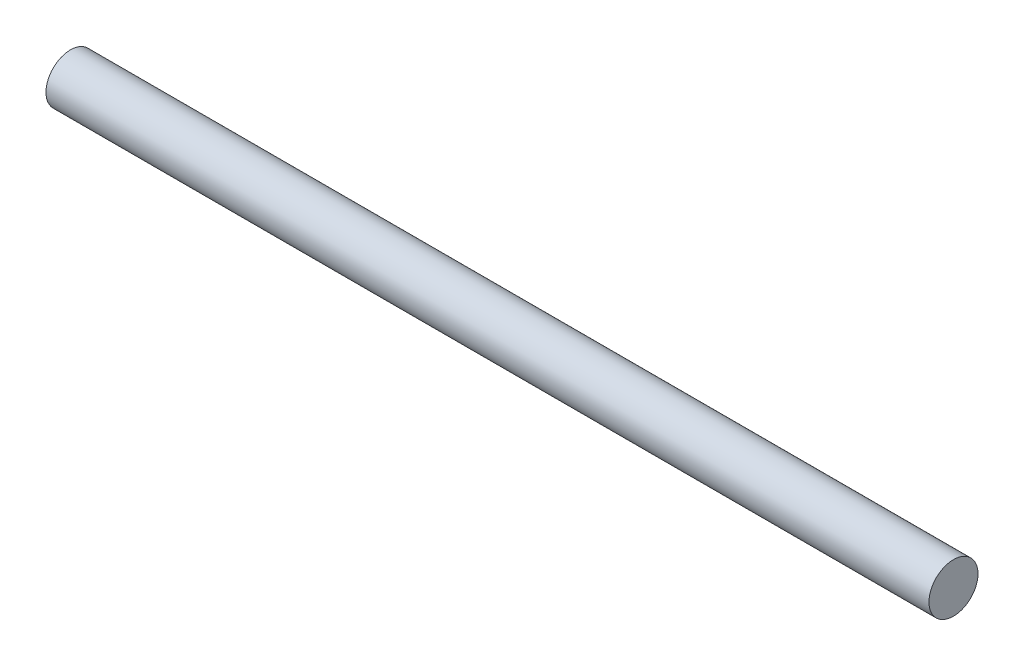
ISO-10303-21;
HEADER;
FILE_DESCRIPTION(('STEP AP214'),'2;1');
FILE_NAME('part.step','',(''),(''),'','','');
FILE_SCHEMA(('AUTOMOTIVE_DESIGN { 1 0 10303 214 1 1 1 1 }'));
ENDSEC;
DATA;
#1=APPLICATION_CONTEXT('core data for automotive mechanical design processes');
#2=APPLICATION_PROTOCOL_DEFINITION('international standard','automotive_design',2000,#1);
#3=PRODUCT_CONTEXT('',#1,'mechanical');
#4=PRODUCT('Part','Part','',(#3));
#5=PRODUCT_RELATED_PRODUCT_CATEGORY('part','',(#4));
#6=PRODUCT_DEFINITION_FORMATION('','',#4);
#7=PRODUCT_DEFINITION_CONTEXT('part definition',#1,'design');
#8=PRODUCT_DEFINITION('design','',#6,#7);
#9=PRODUCT_DEFINITION_SHAPE('','',#8);
#10=(LENGTH_UNIT() NAMED_UNIT(*) SI_UNIT(.MILLI.,.METRE.));
#11=(NAMED_UNIT(*) PLANE_ANGLE_UNIT() SI_UNIT($,.RADIAN.));
#12=(NAMED_UNIT(*) SI_UNIT($,.STERADIAN.) SOLID_ANGLE_UNIT());
#13=UNCERTAINTY_MEASURE_WITH_UNIT(LENGTH_MEASURE(1.E-05),#10,'distance_accuracy_value','');
#14=(GEOMETRIC_REPRESENTATION_CONTEXT(3) GLOBAL_UNCERTAINTY_ASSIGNED_CONTEXT((#13)) GLOBAL_UNIT_ASSIGNED_CONTEXT((#10,
#11,#12)) REPRESENTATION_CONTEXT('',''));
#15=CARTESIAN_POINT('',(0.,0.,0.));
#16=DIRECTION('',(0.,0.,1.));
#17=DIRECTION('',(1.,0.,0.));
#18=AXIS2_PLACEMENT_3D('',#15,#16,#17);
#19=CARTESIAN_POINT('',(228.6,0.,0.));
#20=DIRECTION('',(-1.,0.,0.));
#21=DIRECTION('',(0.,0.,1.));
#22=AXIS2_PLACEMENT_3D('',#19,#20,#21);
#23=CYLINDRICAL_SURFACE('',#22,6.35);
#24=CARTESIAN_POINT('',(228.6,0.,0.));
#25=DIRECTION('',(1.,0.,0.));
#26=DIRECTION('',(0.,0.,-1.));
#27=AXIS2_PLACEMENT_3D('',#24,#25,#26);
#28=CIRCLE('',#27,6.35);
#29=CARTESIAN_POINT('',(228.6,0.,-6.35));
#30=VERTEX_POINT('',#29);
#31=EDGE_CURVE('E10',#30,#30,#28,.T.);
#32=ORIENTED_EDGE('',*,*,#31,.F.);
#33=EDGE_LOOP('',(#32));
#34=FACE_BOUND('',#33,.T.);
#35=CARTESIAN_POINT('',(0.,0.,0.));
#36=DIRECTION('',(1.,0.,0.));
#37=DIRECTION('',(0.,0.,-1.));
#38=AXIS2_PLACEMENT_3D('',#35,#36,#37);
#39=CIRCLE('',#38,6.35);
#40=CARTESIAN_POINT('',(0.,0.,-6.35));
#41=VERTEX_POINT('',#40);
#42=EDGE_CURVE('E33',#41,#41,#39,.T.);
#43=ORIENTED_EDGE('',*,*,#42,.T.);
#44=EDGE_LOOP('',(#43));
#45=FACE_BOUND('',#44,.T.);
#46=ADVANCED_FACE('F30',(#34,#45),#23,.T.);
#47=CARTESIAN_POINT('',(228.6,0.,0.));
#48=DIRECTION('',(1.,0.,0.));
#49=DIRECTION('',(0.,0.,-1.));
#50=AXIS2_PLACEMENT_3D('',#47,#48,#49);
#51=PLANE('',#50);
#52=ORIENTED_EDGE('',*,*,#31,.T.);
#53=EDGE_LOOP('',(#52));
#54=FACE_BOUND('',#53,.T.);
#55=ADVANCED_FACE('F45',(#54),#51,.T.);
#56=CARTESIAN_POINT('',(0.,0.,0.));
#57=DIRECTION('',(1.,0.,0.));
#58=DIRECTION('',(0.,0.,-1.));
#59=AXIS2_PLACEMENT_3D('',#56,#57,#58);
#60=PLANE('',#59);
#61=ORIENTED_EDGE('',*,*,#42,.F.);
#62=EDGE_LOOP('',(#61));
#63=FACE_BOUND('',#62,.T.);
#64=ADVANCED_FACE('F43',(#63),#60,.F.);
#65=CLOSED_SHELL('',(#46,#55,#64));
#66=MANIFOLD_SOLID_BREP('B2',#65);
#67=ADVANCED_BREP_SHAPE_REPRESENTATION('',(#18,#66),#14);
#68=SHAPE_DEFINITION_REPRESENTATION(#9,#67);
ENDSEC;
END-ISO-10303-21;
